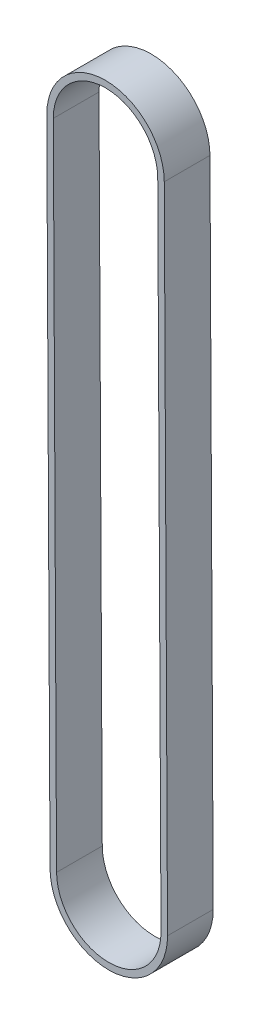
ISO-10303-21;
HEADER;
FILE_DESCRIPTION(('STEP AP214'),'2;1');
FILE_NAME('part.step','',(''),(''),'','','');
FILE_SCHEMA(('AUTOMOTIVE_DESIGN { 1 0 10303 214 1 1 1 1 }'));
ENDSEC;
DATA;
#1=APPLICATION_CONTEXT('core data for automotive mechanical design processes');
#2=APPLICATION_PROTOCOL_DEFINITION('international standard','automotive_design',2000,#1);
#3=PRODUCT_CONTEXT('',#1,'mechanical');
#4=PRODUCT('Part','Part','',(#3));
#5=PRODUCT_RELATED_PRODUCT_CATEGORY('part','',(#4));
#6=PRODUCT_DEFINITION_FORMATION('','',#4);
#7=PRODUCT_DEFINITION_CONTEXT('part definition',#1,'design');
#8=PRODUCT_DEFINITION('design','',#6,#7);
#9=PRODUCT_DEFINITION_SHAPE('','',#8);
#10=(LENGTH_UNIT() NAMED_UNIT(*) SI_UNIT(.MILLI.,.METRE.));
#11=(NAMED_UNIT(*) PLANE_ANGLE_UNIT() SI_UNIT($,.RADIAN.));
#12=(NAMED_UNIT(*) SI_UNIT($,.STERADIAN.) SOLID_ANGLE_UNIT());
#13=UNCERTAINTY_MEASURE_WITH_UNIT(LENGTH_MEASURE(1.E-05),#10,'distance_accuracy_value','');
#14=(GEOMETRIC_REPRESENTATION_CONTEXT(3) GLOBAL_UNCERTAINTY_ASSIGNED_CONTEXT((#13)) GLOBAL_UNIT_ASSIGNED_CONTEXT((#10,
#11,#12)) REPRESENTATION_CONTEXT('',''));
#15=CARTESIAN_POINT('',(0.,0.,0.));
#16=DIRECTION('',(0.,0.,1.));
#17=DIRECTION('',(1.,0.,0.));
#18=AXIS2_PLACEMENT_3D('',#15,#16,#17);
#19=CARTESIAN_POINT('',(-4.30211422042248E-13,5.13478148889135E-13,0.));
#20=DIRECTION('',(0.,0.,-1.));
#21=DIRECTION('',(-1.,0.,0.));
#22=AXIS2_PLACEMENT_3D('',#19,#20,#21);
#23=PLANE('',#22);
#24=CARTESIAN_POINT('',(-4.30211422042248E-13,5.13478148889135E-13,0.));
#25=DIRECTION('',(0.,0.,-1.));
#26=DIRECTION('',(-1.,0.,0.));
#27=AXIS2_PLACEMENT_3D('',#24,#25,#26);
#28=CIRCLE('',#27,9.);
#29=CARTESIAN_POINT('',(8.99988702813416,0.0450941328201456,0.));
#30=VERTEX_POINT('',#29);
#31=CARTESIAN_POINT('',(-8.99988702813502,-0.0450941328190846,0.));
#32=VERTEX_POINT('',#31);
#33=EDGE_CURVE('E158',#30,#32,#28,.F.);
#34=ORIENTED_EDGE('',*,*,#33,.T.);
#35=DIRECTION('',(0.00501045920218135,-0.99998744757051,0.));
#36=VECTOR('',#35,1.);
#37=CARTESIAN_POINT('',(-8.99988702813502,-0.0450941328191187,0.));
#38=LINE('',#37,#36);
#39=CARTESIAN_POINT('',(-8.49988702813459,-99.8350941328198,0.));
#40=VERTEX_POINT('',#39);
#41=EDGE_CURVE('E161',#32,#40,#38,.T.);
#42=ORIENTED_EDGE('',*,*,#41,.T.);
#43=CARTESIAN_POINT('',(0.499999999999995,-99.7900000000002,0.));
#44=DIRECTION('',(0.,0.,-1.));
#45=DIRECTION('',(-1.,0.,0.));
#46=AXIS2_PLACEMENT_3D('',#43,#44,#45);
#47=CIRCLE('',#46,9.);
#48=CARTESIAN_POINT('',(9.49988702813459,-99.7449058671806,0.));
#49=VERTEX_POINT('',#48);
#50=EDGE_CURVE('E164',#40,#49,#47,.F.);
#51=ORIENTED_EDGE('',*,*,#50,.T.);
#52=DIRECTION('',(-0.00501045920218135,0.99998744757051,0.));
#53=VECTOR('',#52,1.);
#54=CARTESIAN_POINT('',(8.99988702813416,0.0450941328201456,0.));
#55=LINE('',#54,#53);
#56=EDGE_CURVE('E166',#49,#30,#55,.T.);
#57=ORIENTED_EDGE('',*,*,#56,.T.);
#58=EDGE_LOOP('',(#34,#42,#51,#57));
#59=FACE_BOUND('',#58,.T.);
#60=CARTESIAN_POINT('',(-4.30211422042248E-13,5.13478148889135E-13,0.));
#61=DIRECTION('',(0.,0.,1.));
#62=DIRECTION('',(-1.,0.,0.));
#63=AXIS2_PLACEMENT_3D('',#60,#61,#62);
#64=CIRCLE('',#63,8.);
#65=CARTESIAN_POINT('',(7.99989958056365,0.0400836736179643,0.));
#66=VERTEX_POINT('',#65);
#67=CARTESIAN_POINT('',(-7.99989958056451,-0.0400836736169373,0.));
#68=VERTEX_POINT('',#67);
#69=EDGE_CURVE('E122',#66,#68,#64,.T.);
#70=ORIENTED_EDGE('',*,*,#69,.F.);
#71=DIRECTION('',(-0.00501045920218135,0.99998744757051,0.));
#72=VECTOR('',#71,1.);
#73=CARTESIAN_POINT('',(7.99989958056365,0.0400836736179643,0.));
#74=LINE('',#73,#72);
#75=CARTESIAN_POINT('',(8.49989958056407,-99.7499163263828,0.));
#76=VERTEX_POINT('',#75);
#77=EDGE_CURVE('E144',#76,#66,#74,.T.);
#78=ORIENTED_EDGE('',*,*,#77,.F.);
#79=CARTESIAN_POINT('',(0.499999999999995,-99.7900000000002,0.));
#80=DIRECTION('',(0.,0.,1.));
#81=DIRECTION('',(-1.,0.,0.));
#82=AXIS2_PLACEMENT_3D('',#79,#80,#81);
#83=CIRCLE('',#82,8.);
#84=CARTESIAN_POINT('',(-7.49989958056408,-99.8300836736177,0.));
#85=VERTEX_POINT('',#84);
#86=EDGE_CURVE('E142',#85,#76,#83,.T.);
#87=ORIENTED_EDGE('',*,*,#86,.F.);
#88=DIRECTION('',(0.00501045920218135,-0.99998744757051,0.));
#89=VECTOR('',#88,1.);
#90=CARTESIAN_POINT('',(-7.49989958056408,-99.8300836736177,0.));
#91=LINE('',#90,#89);
#92=EDGE_CURVE('E130',#68,#85,#91,.T.);
#93=ORIENTED_EDGE('',*,*,#92,.F.);
#94=EDGE_LOOP('',(#70,#78,#87,#93));
#95=FACE_BOUND('',#94,.T.);
#96=ADVANCED_FACE('F57',(#59,#95),#23,.F.);
#97=CARTESIAN_POINT('',(-4.30211422042248E-13,5.13478148889135E-13,-7.));
#98=DIRECTION('',(0.,0.,-1.));
#99=DIRECTION('',(-1.,0.,0.));
#100=AXIS2_PLACEMENT_3D('',#97,#98,#99);
#101=PLANE('',#100);
#102=CARTESIAN_POINT('',(-4.30211422042248E-13,5.13478148889135E-13,-7.));
#103=DIRECTION('',(0.,0.,-1.));
#104=DIRECTION('',(-1.,0.,0.));
#105=AXIS2_PLACEMENT_3D('',#102,#103,#104);
#106=CIRCLE('',#105,9.);
#107=CARTESIAN_POINT('',(8.99988702813416,0.0450941328201456,-7.));
#108=VERTEX_POINT('',#107);
#109=CARTESIAN_POINT('',(-8.99988702813502,-0.0450941328190846,-7.));
#110=VERTEX_POINT('',#109);
#111=EDGE_CURVE('E138',#108,#110,#106,.F.);
#112=ORIENTED_EDGE('',*,*,#111,.F.);
#113=DIRECTION('',(-0.00501045920218135,0.99998744757051,0.));
#114=VECTOR('',#113,1.);
#115=CARTESIAN_POINT('',(8.99988702813416,0.0450941328201456,-7.));
#116=LINE('',#115,#114);
#117=CARTESIAN_POINT('',(9.49988702813459,-99.7449058671806,-7.));
#118=VERTEX_POINT('',#117);
#119=EDGE_CURVE('E162',#118,#108,#116,.T.);
#120=ORIENTED_EDGE('',*,*,#119,.F.);
#121=CARTESIAN_POINT('',(0.499999999999995,-99.7900000000002,-7.));
#122=DIRECTION('',(0.,0.,-1.));
#123=DIRECTION('',(-1.,0.,0.));
#124=AXIS2_PLACEMENT_3D('',#121,#122,#123);
#125=CIRCLE('',#124,9.);
#126=CARTESIAN_POINT('',(-8.49988702813459,-99.8350941328198,-7.));
#127=VERTEX_POINT('',#126);
#128=EDGE_CURVE('E173',#127,#118,#125,.F.);
#129=ORIENTED_EDGE('',*,*,#128,.F.);
#130=DIRECTION('',(0.00501045920218135,-0.99998744757051,0.));
#131=VECTOR('',#130,1.);
#132=CARTESIAN_POINT('',(-8.99988702813502,-0.0450941328191187,-7.));
#133=LINE('',#132,#131);
#134=EDGE_CURVE('E171',#110,#127,#133,.T.);
#135=ORIENTED_EDGE('',*,*,#134,.F.);
#136=EDGE_LOOP('',(#112,#120,#129,#135));
#137=FACE_BOUND('',#136,.T.);
#138=DIRECTION('',(-0.00501045920218135,0.99998744757051,0.));
#139=VECTOR('',#138,1.);
#140=CARTESIAN_POINT('',(7.99989958056365,0.0400836736179643,-7.));
#141=LINE('',#140,#139);
#142=CARTESIAN_POINT('',(8.49989958056407,-99.7499163263828,-7.));
#143=VERTEX_POINT('',#142);
#144=CARTESIAN_POINT('',(7.99989958056365,0.0400836736179643,-7.));
#145=VERTEX_POINT('',#144);
#146=EDGE_CURVE('E131',#143,#145,#141,.T.);
#147=ORIENTED_EDGE('',*,*,#146,.T.);
#148=CARTESIAN_POINT('',(-4.30211422042248E-13,5.13478148889135E-13,-7.));
#149=DIRECTION('',(0.,0.,1.));
#150=DIRECTION('',(-1.,0.,0.));
#151=AXIS2_PLACEMENT_3D('',#148,#149,#150);
#152=CIRCLE('',#151,8.);
#153=CARTESIAN_POINT('',(-7.99989958056451,-0.0400836736169373,-7.));
#154=VERTEX_POINT('',#153);
#155=EDGE_CURVE('E80',#145,#154,#152,.T.);
#156=ORIENTED_EDGE('',*,*,#155,.T.);
#157=DIRECTION('',(0.00501045920218135,-0.99998744757051,0.));
#158=VECTOR('',#157,1.);
#159=CARTESIAN_POINT('',(-7.49989958056408,-99.8300836736177,-7.));
#160=LINE('',#159,#158);
#161=CARTESIAN_POINT('',(-7.49989958056408,-99.8300836736177,-7.));
#162=VERTEX_POINT('',#161);
#163=EDGE_CURVE('E137',#154,#162,#160,.T.);
#164=ORIENTED_EDGE('',*,*,#163,.T.);
#165=CARTESIAN_POINT('',(0.499999999999995,-99.7900000000002,-7.));
#166=DIRECTION('',(0.,0.,1.));
#167=DIRECTION('',(-1.,0.,0.));
#168=AXIS2_PLACEMENT_3D('',#165,#166,#167);
#169=CIRCLE('',#168,8.);
#170=EDGE_CURVE('E150',#162,#143,#169,.T.);
#171=ORIENTED_EDGE('',*,*,#170,.T.);
#172=EDGE_LOOP('',(#147,#156,#164,#171));
#173=FACE_BOUND('',#172,.T.);
#174=ADVANCED_FACE('F191',(#137,#173),#101,.T.);
#175=CARTESIAN_POINT('',(-4.30211422042248E-13,5.13478148889135E-13,0.));
#176=DIRECTION('',(0.,0.,-1.));
#177=DIRECTION('',(-1.,0.,0.));
#178=AXIS2_PLACEMENT_3D('',#175,#176,#177);
#179=CYLINDRICAL_SURFACE('',#178,9.);
#180=ORIENTED_EDGE('',*,*,#111,.T.);
#181=DIRECTION('',(0.,0.,-1.));
#182=VECTOR('',#181,1.);
#183=CARTESIAN_POINT('',(-8.99988702813502,-0.0450941328190846,0.));
#184=LINE('',#183,#182);
#185=EDGE_CURVE('E12',#32,#110,#184,.T.);
#186=ORIENTED_EDGE('',*,*,#185,.F.);
#187=ORIENTED_EDGE('',*,*,#33,.F.);
#188=DIRECTION('',(0.,0.,-1.));
#189=VECTOR('',#188,1.);
#190=CARTESIAN_POINT('',(8.99988702813416,0.0450941328201456,0.));
#191=LINE('',#190,#189);
#192=EDGE_CURVE('E168',#30,#108,#191,.T.);
#193=ORIENTED_EDGE('',*,*,#192,.T.);
#194=EDGE_LOOP('',(#180,#186,#187,#193));
#195=FACE_BOUND('',#194,.T.);
#196=ADVANCED_FACE('F59',(#195),#179,.T.);
#197=CARTESIAN_POINT('',(-8.99988702813502,-0.0450941328191187,0.));
#198=DIRECTION('',(0.99998744757051,0.00501045920218135,0.));
#199=DIRECTION('',(-0.00501045920218135,0.99998744757051,0.));
#200=AXIS2_PLACEMENT_3D('',#197,#198,#199);
#201=PLANE('',#200);
#202=ORIENTED_EDGE('',*,*,#134,.T.);
#203=DIRECTION('',(0.,0.,-1.));
#204=VECTOR('',#203,1.);
#205=CARTESIAN_POINT('',(-8.49988702813459,-99.8350941328198,0.));
#206=LINE('',#205,#204);
#207=EDGE_CURVE('E65',#40,#127,#206,.T.);
#208=ORIENTED_EDGE('',*,*,#207,.F.);
#209=ORIENTED_EDGE('',*,*,#41,.F.);
#210=ORIENTED_EDGE('',*,*,#185,.T.);
#211=EDGE_LOOP('',(#202,#208,#209,#210));
#212=FACE_BOUND('',#211,.T.);
#213=ADVANCED_FACE('F201',(#212),#201,.F.);
#214=CARTESIAN_POINT('',(0.499999999999995,-99.7900000000002,0.));
#215=DIRECTION('',(0.,0.,-1.));
#216=DIRECTION('',(-1.,0.,0.));
#217=AXIS2_PLACEMENT_3D('',#214,#215,#216);
#218=CYLINDRICAL_SURFACE('',#217,9.);
#219=ORIENTED_EDGE('',*,*,#128,.T.);
#220=DIRECTION('',(0.,0.,-1.));
#221=VECTOR('',#220,1.);
#222=CARTESIAN_POINT('',(9.49988702813459,-99.7449058671806,0.));
#223=LINE('',#222,#221);
#224=EDGE_CURVE('E178',#49,#118,#223,.T.);
#225=ORIENTED_EDGE('',*,*,#224,.F.);
#226=ORIENTED_EDGE('',*,*,#50,.F.);
#227=ORIENTED_EDGE('',*,*,#207,.T.);
#228=EDGE_LOOP('',(#219,#225,#226,#227));
#229=FACE_BOUND('',#228,.T.);
#230=ADVANCED_FACE('F185',(#229),#218,.T.);
#231=CARTESIAN_POINT('',(8.99988702813416,0.0450941328201456,0.));
#232=DIRECTION('',(-0.99998744757051,-0.00501045920218135,0.));
#233=DIRECTION('',(0.00501045920218135,-0.99998744757051,0.));
#234=AXIS2_PLACEMENT_3D('',#231,#232,#233);
#235=PLANE('',#234);
#236=ORIENTED_EDGE('',*,*,#119,.T.);
#237=ORIENTED_EDGE('',*,*,#192,.F.);
#238=ORIENTED_EDGE('',*,*,#56,.F.);
#239=ORIENTED_EDGE('',*,*,#224,.T.);
#240=EDGE_LOOP('',(#236,#237,#238,#239));
#241=FACE_BOUND('',#240,.T.);
#242=ADVANCED_FACE('F195',(#241),#235,.F.);
#243=CARTESIAN_POINT('',(-4.30211422042248E-13,5.13478148889135E-13,0.));
#244=DIRECTION('',(0.,0.,-1.));
#245=DIRECTION('',(-1.,0.,0.));
#246=AXIS2_PLACEMENT_3D('',#243,#244,#245);
#247=CYLINDRICAL_SURFACE('',#246,8.);
#248=ORIENTED_EDGE('',*,*,#155,.F.);
#249=DIRECTION('',(0.,0.,-1.));
#250=VECTOR('',#249,1.);
#251=CARTESIAN_POINT('',(7.99989958056365,0.0400836736179643,0.));
#252=LINE('',#251,#250);
#253=EDGE_CURVE('E126',#66,#145,#252,.T.);
#254=ORIENTED_EDGE('',*,*,#253,.F.);
#255=ORIENTED_EDGE('',*,*,#69,.T.);
#256=DIRECTION('',(0.,0.,-1.));
#257=VECTOR('',#256,1.);
#258=CARTESIAN_POINT('',(-7.99989958056451,-0.0400836736169373,0.));
#259=LINE('',#258,#257);
#260=EDGE_CURVE('E125',#68,#154,#259,.T.);
#261=ORIENTED_EDGE('',*,*,#260,.T.);
#262=EDGE_LOOP('',(#248,#254,#255,#261));
#263=FACE_BOUND('',#262,.T.);
#264=ADVANCED_FACE('F124',(#263),#247,.F.);
#265=CARTESIAN_POINT('',(-7.49989958056408,-99.8300836736177,0.));
#266=DIRECTION('',(0.99998744757051,0.00501045920218135,0.));
#267=DIRECTION('',(-0.00501045920218135,0.99998744757051,0.));
#268=AXIS2_PLACEMENT_3D('',#265,#266,#267);
#269=PLANE('',#268);
#270=ORIENTED_EDGE('',*,*,#163,.F.);
#271=ORIENTED_EDGE('',*,*,#260,.F.);
#272=ORIENTED_EDGE('',*,*,#92,.T.);
#273=DIRECTION('',(0.,0.,-1.));
#274=VECTOR('',#273,1.);
#275=CARTESIAN_POINT('',(-7.49989958056408,-99.8300836736177,0.));
#276=LINE('',#275,#274);
#277=EDGE_CURVE('E139',#85,#162,#276,.T.);
#278=ORIENTED_EDGE('',*,*,#277,.T.);
#279=EDGE_LOOP('',(#270,#271,#272,#278));
#280=FACE_BOUND('',#279,.T.);
#281=ADVANCED_FACE('F134',(#280),#269,.T.);
#282=CARTESIAN_POINT('',(0.499999999999995,-99.7900000000002,0.));
#283=DIRECTION('',(0.,0.,-1.));
#284=DIRECTION('',(-1.,0.,0.));
#285=AXIS2_PLACEMENT_3D('',#282,#283,#284);
#286=CYLINDRICAL_SURFACE('',#285,8.);
#287=ORIENTED_EDGE('',*,*,#170,.F.);
#288=ORIENTED_EDGE('',*,*,#277,.F.);
#289=ORIENTED_EDGE('',*,*,#86,.T.);
#290=DIRECTION('',(0.,0.,-1.));
#291=VECTOR('',#290,1.);
#292=CARTESIAN_POINT('',(8.49989958056407,-99.7499163263828,0.));
#293=LINE('',#292,#291);
#294=EDGE_CURVE('E72',#76,#143,#293,.T.);
#295=ORIENTED_EDGE('',*,*,#294,.T.);
#296=EDGE_LOOP('',(#287,#288,#289,#295));
#297=FACE_BOUND('',#296,.T.);
#298=ADVANCED_FACE('F224',(#297),#286,.F.);
#299=CARTESIAN_POINT('',(7.99989958056365,0.0400836736179643,0.));
#300=DIRECTION('',(-0.99998744757051,-0.00501045920218135,0.));
#301=DIRECTION('',(0.00501045920218135,-0.99998744757051,0.));
#302=AXIS2_PLACEMENT_3D('',#299,#300,#301);
#303=PLANE('',#302);
#304=ORIENTED_EDGE('',*,*,#146,.F.);
#305=ORIENTED_EDGE('',*,*,#294,.F.);
#306=ORIENTED_EDGE('',*,*,#77,.T.);
#307=ORIENTED_EDGE('',*,*,#253,.T.);
#308=EDGE_LOOP('',(#304,#305,#306,#307));
#309=FACE_BOUND('',#308,.T.);
#310=ADVANCED_FACE('F228',(#309),#303,.T.);
#311=CLOSED_SHELL('',(#96,#174,#196,#213,#230,#242,#264,#281,#298,#310));
#312=MANIFOLD_SOLID_BREP('B2',#311);
#313=ADVANCED_BREP_SHAPE_REPRESENTATION('',(#18,#312),#14);
#314=SHAPE_DEFINITION_REPRESENTATION(#9,#313);
ENDSEC;
END-ISO-10303-21;
